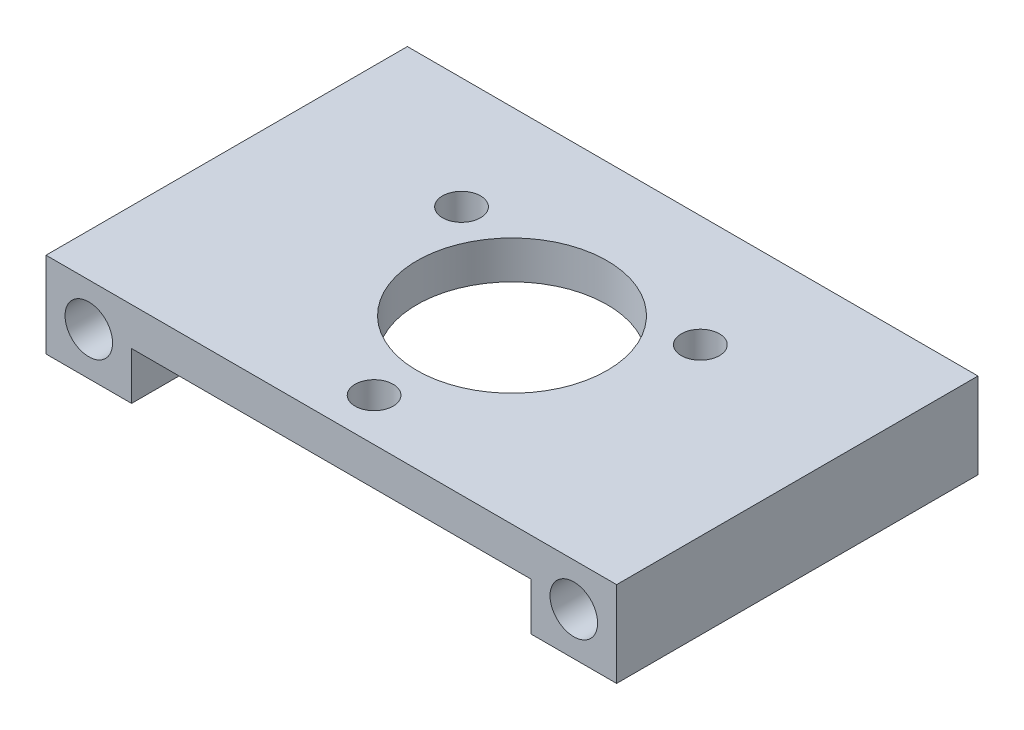
ISO-10303-21;
HEADER;
FILE_DESCRIPTION(('STEP AP214'),'2;1');
FILE_NAME('part.step','',(''),(''),'','','');
FILE_SCHEMA(('AUTOMOTIVE_DESIGN { 1 0 10303 214 1 1 1 1 }'));
ENDSEC;
DATA;
#1=APPLICATION_CONTEXT('core data for automotive mechanical design processes');
#2=APPLICATION_PROTOCOL_DEFINITION('international standard','automotive_design',2000,#1);
#3=PRODUCT_CONTEXT('',#1,'mechanical');
#4=PRODUCT('Part','Part','',(#3));
#5=PRODUCT_RELATED_PRODUCT_CATEGORY('part','',(#4));
#6=PRODUCT_DEFINITION_FORMATION('','',#4);
#7=PRODUCT_DEFINITION_CONTEXT('part definition',#1,'design');
#8=PRODUCT_DEFINITION('design','',#6,#7);
#9=PRODUCT_DEFINITION_SHAPE('','',#8);
#10=(LENGTH_UNIT() NAMED_UNIT(*) SI_UNIT(.MILLI.,.METRE.));
#11=(NAMED_UNIT(*) PLANE_ANGLE_UNIT() SI_UNIT($,.RADIAN.));
#12=(NAMED_UNIT(*) SI_UNIT($,.STERADIAN.) SOLID_ANGLE_UNIT());
#13=UNCERTAINTY_MEASURE_WITH_UNIT(LENGTH_MEASURE(1.E-05),#10,'distance_accuracy_value','');
#14=(GEOMETRIC_REPRESENTATION_CONTEXT(3) GLOBAL_UNCERTAINTY_ASSIGNED_CONTEXT((#13)) GLOBAL_UNIT_ASSIGNED_CONTEXT((#10,
#11,#12)) REPRESENTATION_CONTEXT('',''));
#15=CARTESIAN_POINT('',(0.,0.,0.));
#16=DIRECTION('',(0.,0.,1.));
#17=DIRECTION('',(1.,0.,0.));
#18=AXIS2_PLACEMENT_3D('',#15,#16,#17);
#19=CARTESIAN_POINT('',(0.,0.,38.));
#20=DIRECTION('',(0.,0.,-1.));
#21=DIRECTION('',(-1.,0.,0.));
#22=AXIS2_PLACEMENT_3D('',#19,#20,#21);
#23=PLANE('',#22);
#24=DIRECTION('',(-1.,0.,0.));
#25=VECTOR('',#24,1.);
#26=CARTESIAN_POINT('',(-30.,0.,38.));
#27=LINE('',#26,#25);
#28=CARTESIAN_POINT('',(30.,0.,38.));
#29=VERTEX_POINT('',#28);
#30=CARTESIAN_POINT('',(-30.,0.,38.));
#31=VERTEX_POINT('',#30);
#32=EDGE_CURVE('E145',#29,#31,#27,.T.);
#33=ORIENTED_EDGE('',*,*,#32,.T.);
#34=DIRECTION('',(0.,-1.,0.));
#35=VECTOR('',#34,1.);
#36=CARTESIAN_POINT('',(-30.,0.,38.));
#37=LINE('',#36,#35);
#38=CARTESIAN_POINT('',(-30.,-9.00000000000001,38.));
#39=VERTEX_POINT('',#38);
#40=EDGE_CURVE('E93',#31,#39,#37,.T.);
#41=ORIENTED_EDGE('',*,*,#40,.T.);
#42=DIRECTION('',(1.,0.,0.));
#43=VECTOR('',#42,1.);
#44=CARTESIAN_POINT('',(-30.,-9.00000000000001,38.));
#45=LINE('',#44,#43);
#46=CARTESIAN_POINT('',(-21.,-9.00000000000001,38.));
#47=VERTEX_POINT('',#46);
#48=EDGE_CURVE('E160',#39,#47,#45,.T.);
#49=ORIENTED_EDGE('',*,*,#48,.T.);
#50=DIRECTION('',(0.,1.,0.));
#51=VECTOR('',#50,1.);
#52=CARTESIAN_POINT('',(-21.,-9.00000000000001,38.));
#53=LINE('',#52,#51);
#54=CARTESIAN_POINT('',(-21.,-4.,38.));
#55=VERTEX_POINT('',#54);
#56=EDGE_CURVE('E173',#47,#55,#53,.T.);
#57=ORIENTED_EDGE('',*,*,#56,.T.);
#58=DIRECTION('',(1.,0.,0.));
#59=VECTOR('',#58,1.);
#60=CARTESIAN_POINT('',(-21.,-4.,38.));
#61=LINE('',#60,#59);
#62=CARTESIAN_POINT('',(21.,-4.,38.));
#63=VERTEX_POINT('',#62);
#64=EDGE_CURVE('E112',#55,#63,#61,.T.);
#65=ORIENTED_EDGE('',*,*,#64,.T.);
#66=DIRECTION('',(0.,-1.,0.));
#67=VECTOR('',#66,1.);
#68=CARTESIAN_POINT('',(21.,-9.,38.));
#69=LINE('',#68,#67);
#70=CARTESIAN_POINT('',(21.,-9.,38.));
#71=VERTEX_POINT('',#70);
#72=EDGE_CURVE('E106',#63,#71,#69,.T.);
#73=ORIENTED_EDGE('',*,*,#72,.T.);
#74=DIRECTION('',(1.,0.,0.));
#75=VECTOR('',#74,1.);
#76=CARTESIAN_POINT('',(30.,-9.,38.));
#77=LINE('',#76,#75);
#78=CARTESIAN_POINT('',(30.,-9.,38.));
#79=VERTEX_POINT('',#78);
#80=EDGE_CURVE('E110',#71,#79,#77,.T.);
#81=ORIENTED_EDGE('',*,*,#80,.T.);
#82=DIRECTION('',(0.,1.,0.));
#83=VECTOR('',#82,1.);
#84=CARTESIAN_POINT('',(30.,0.,38.));
#85=LINE('',#84,#83);
#86=EDGE_CURVE('E50',#79,#29,#85,.T.);
#87=ORIENTED_EDGE('',*,*,#86,.T.);
#88=EDGE_LOOP('',(#33,#41,#49,#57,#65,#73,#81,#87));
#89=FACE_BOUND('',#88,.T.);
#90=CARTESIAN_POINT('',(25.5,-4.5,38.));
#91=DIRECTION('',(0.,0.,1.));
#92=DIRECTION('',(-1.,0.,0.));
#93=AXIS2_PLACEMENT_3D('',#90,#91,#92);
#94=CIRCLE('',#93,2.5);
#95=CARTESIAN_POINT('',(23.,-4.5,38.));
#96=VERTEX_POINT('',#95);
#97=EDGE_CURVE('E134',#96,#96,#94,.T.);
#98=ORIENTED_EDGE('',*,*,#97,.F.);
#99=EDGE_LOOP('',(#98));
#100=FACE_BOUND('',#99,.T.);
#101=CARTESIAN_POINT('',(-25.5,-4.5,38.));
#102=DIRECTION('',(0.,0.,1.));
#103=DIRECTION('',(1.,0.,0.));
#104=AXIS2_PLACEMENT_3D('',#101,#102,#103);
#105=CIRCLE('',#104,2.5);
#106=CARTESIAN_POINT('',(-23.,-4.5,38.));
#107=VERTEX_POINT('',#106);
#108=EDGE_CURVE('E182',#107,#107,#105,.T.);
#109=ORIENTED_EDGE('',*,*,#108,.F.);
#110=EDGE_LOOP('',(#109));
#111=FACE_BOUND('',#110,.T.);
#112=ADVANCED_FACE('F33',(#89,#100,#111),#23,.F.);
#113=CARTESIAN_POINT('',(0.,0.,0.));
#114=DIRECTION('',(0.,0.,-1.));
#115=DIRECTION('',(-1.,0.,0.));
#116=AXIS2_PLACEMENT_3D('',#113,#114,#115);
#117=PLANE('',#116);
#118=CARTESIAN_POINT('',(25.5,-4.5,0.));
#119=DIRECTION('',(0.,0.,1.));
#120=DIRECTION('',(-1.,0.,0.));
#121=AXIS2_PLACEMENT_3D('',#118,#119,#120);
#122=CIRCLE('',#121,2.5);
#123=CARTESIAN_POINT('',(23.,-4.5,0.));
#124=VERTEX_POINT('',#123);
#125=EDGE_CURVE('E179',#124,#124,#122,.T.);
#126=ORIENTED_EDGE('',*,*,#125,.T.);
#127=EDGE_LOOP('',(#126));
#128=FACE_BOUND('',#127,.T.);
#129=DIRECTION('',(-1.,0.,0.));
#130=VECTOR('',#129,1.);
#131=CARTESIAN_POINT('',(-30.,0.,0.));
#132=LINE('',#131,#130);
#133=CARTESIAN_POINT('',(30.,0.,0.));
#134=VERTEX_POINT('',#133);
#135=CARTESIAN_POINT('',(-30.,0.,0.));
#136=VERTEX_POINT('',#135);
#137=EDGE_CURVE('E130',#134,#136,#132,.T.);
#138=ORIENTED_EDGE('',*,*,#137,.F.);
#139=DIRECTION('',(0.,1.,0.));
#140=VECTOR('',#139,1.);
#141=CARTESIAN_POINT('',(30.,0.,0.));
#142=LINE('',#141,#140);
#143=CARTESIAN_POINT('',(30.,-9.,0.));
#144=VERTEX_POINT('',#143);
#145=EDGE_CURVE('E85',#144,#134,#142,.T.);
#146=ORIENTED_EDGE('',*,*,#145,.F.);
#147=DIRECTION('',(1.,0.,0.));
#148=VECTOR('',#147,1.);
#149=CARTESIAN_POINT('',(30.,-9.,0.));
#150=LINE('',#149,#148);
#151=CARTESIAN_POINT('',(21.,-9.,0.));
#152=VERTEX_POINT('',#151);
#153=EDGE_CURVE('E79',#152,#144,#150,.T.);
#154=ORIENTED_EDGE('',*,*,#153,.F.);
#155=DIRECTION('',(0.,-1.,0.));
#156=VECTOR('',#155,1.);
#157=CARTESIAN_POINT('',(21.,-9.,0.));
#158=LINE('',#157,#156);
#159=CARTESIAN_POINT('',(21.,-4.,0.));
#160=VERTEX_POINT('',#159);
#161=EDGE_CURVE('E120',#160,#152,#158,.T.);
#162=ORIENTED_EDGE('',*,*,#161,.F.);
#163=DIRECTION('',(1.,0.,0.));
#164=VECTOR('',#163,1.);
#165=CARTESIAN_POINT('',(-21.,-4.,0.));
#166=LINE('',#165,#164);
#167=CARTESIAN_POINT('',(-21.,-4.,0.));
#168=VERTEX_POINT('',#167);
#169=EDGE_CURVE('E140',#168,#160,#166,.T.);
#170=ORIENTED_EDGE('',*,*,#169,.F.);
#171=DIRECTION('',(0.,1.,0.));
#172=VECTOR('',#171,1.);
#173=CARTESIAN_POINT('',(-21.,-9.00000000000001,0.));
#174=LINE('',#173,#172);
#175=CARTESIAN_POINT('',(-21.,-9.00000000000001,0.));
#176=VERTEX_POINT('',#175);
#177=EDGE_CURVE('E138',#176,#168,#174,.T.);
#178=ORIENTED_EDGE('',*,*,#177,.F.);
#179=DIRECTION('',(1.,0.,0.));
#180=VECTOR('',#179,1.);
#181=CARTESIAN_POINT('',(-30.,-9.00000000000001,0.));
#182=LINE('',#181,#180);
#183=CARTESIAN_POINT('',(-30.,-9.00000000000001,0.));
#184=VERTEX_POINT('',#183);
#185=EDGE_CURVE('E136',#184,#176,#182,.T.);
#186=ORIENTED_EDGE('',*,*,#185,.F.);
#187=DIRECTION('',(0.,-1.,0.));
#188=VECTOR('',#187,1.);
#189=CARTESIAN_POINT('',(-30.,0.,0.));
#190=LINE('',#189,#188);
#191=EDGE_CURVE('E133',#136,#184,#190,.T.);
#192=ORIENTED_EDGE('',*,*,#191,.F.);
#193=EDGE_LOOP('',(#138,#146,#154,#162,#170,#178,#186,#192));
#194=FACE_BOUND('',#193,.T.);
#195=CARTESIAN_POINT('',(-25.5,-4.5,0.));
#196=DIRECTION('',(0.,0.,1.));
#197=DIRECTION('',(1.,0.,0.));
#198=AXIS2_PLACEMENT_3D('',#195,#196,#197);
#199=CIRCLE('',#198,2.5);
#200=CARTESIAN_POINT('',(-23.,-4.5,0.));
#201=VERTEX_POINT('',#200);
#202=EDGE_CURVE('E185',#201,#201,#199,.T.);
#203=ORIENTED_EDGE('',*,*,#202,.T.);
#204=EDGE_LOOP('',(#203));
#205=FACE_BOUND('',#204,.T.);
#206=ADVANCED_FACE('F164',(#128,#194,#205),#117,.T.);
#207=CARTESIAN_POINT('',(-30.,0.,38.));
#208=DIRECTION('',(0.,-1.,0.));
#209=DIRECTION('',(1.,0.,0.));
#210=AXIS2_PLACEMENT_3D('',#207,#208,#209);
#211=PLANE('',#210);
#212=CARTESIAN_POINT('',(-12.5573683548735,0.,11.7499999999996));
#213=DIRECTION('',(0.,-1.,0.));
#214=DIRECTION('',(1.,0.,0.));
#215=AXIS2_PLACEMENT_3D('',#212,#213,#214);
#216=CIRCLE('',#215,2.);
#217=CARTESIAN_POINT('',(-10.5573683548735,0.,11.7499999999996));
#218=VERTEX_POINT('',#217);
#219=EDGE_CURVE('E188',#218,#218,#216,.T.);
#220=ORIENTED_EDGE('',*,*,#219,.T.);
#221=EDGE_LOOP('',(#220));
#222=FACE_BOUND('',#221,.T.);
#223=CARTESIAN_POINT('',(12.5573683548752,0.,11.7500000000005));
#224=DIRECTION('',(0.,-1.,0.));
#225=DIRECTION('',(1.,0.,0.));
#226=AXIS2_PLACEMENT_3D('',#223,#224,#225);
#227=CIRCLE('',#226,2.);
#228=CARTESIAN_POINT('',(14.5573683548752,0.,11.7500000000005));
#229=VERTEX_POINT('',#228);
#230=EDGE_CURVE('E193',#229,#229,#227,.T.);
#231=ORIENTED_EDGE('',*,*,#230,.T.);
#232=EDGE_LOOP('',(#231));
#233=FACE_BOUND('',#232,.T.);
#234=CARTESIAN_POINT('',(0.,0.,33.5));
#235=DIRECTION('',(0.,-1.,0.));
#236=DIRECTION('',(1.,0.,0.));
#237=AXIS2_PLACEMENT_3D('',#234,#235,#236);
#238=CIRCLE('',#237,2.);
#239=CARTESIAN_POINT('',(2.,0.,33.5));
#240=VERTEX_POINT('',#239);
#241=EDGE_CURVE('E196',#240,#240,#238,.T.);
#242=ORIENTED_EDGE('',*,*,#241,.T.);
#243=EDGE_LOOP('',(#242));
#244=FACE_BOUND('',#243,.T.);
#245=CARTESIAN_POINT('',(0.,0.,19.));
#246=DIRECTION('',(0.,-1.,0.));
#247=DIRECTION('',(1.,0.,0.));
#248=AXIS2_PLACEMENT_3D('',#245,#246,#247);
#249=CIRCLE('',#248,10.);
#250=CARTESIAN_POINT('',(10.,0.,19.));
#251=VERTEX_POINT('',#250);
#252=EDGE_CURVE('E199',#251,#251,#249,.T.);
#253=ORIENTED_EDGE('',*,*,#252,.T.);
#254=EDGE_LOOP('',(#253));
#255=FACE_BOUND('',#254,.T.);
#256=ORIENTED_EDGE('',*,*,#137,.T.);
#257=DIRECTION('',(0.,0.,-1.));
#258=VECTOR('',#257,1.);
#259=CARTESIAN_POINT('',(-30.,0.,38.));
#260=LINE('',#259,#258);
#261=EDGE_CURVE('E11',#31,#136,#260,.T.);
#262=ORIENTED_EDGE('',*,*,#261,.F.);
#263=ORIENTED_EDGE('',*,*,#32,.F.);
#264=DIRECTION('',(0.,0.,-1.));
#265=VECTOR('',#264,1.);
#266=CARTESIAN_POINT('',(30.,0.,38.));
#267=LINE('',#266,#265);
#268=EDGE_CURVE('E126',#29,#134,#267,.T.);
#269=ORIENTED_EDGE('',*,*,#268,.T.);
#270=EDGE_LOOP('',(#256,#262,#263,#269));
#271=FACE_BOUND('',#270,.T.);
#272=ADVANCED_FACE('F35',(#222,#233,#244,#255,#271),#211,.F.);
#273=CARTESIAN_POINT('',(-30.,0.,38.));
#274=DIRECTION('',(1.,0.,0.));
#275=DIRECTION('',(0.,0.,-1.));
#276=AXIS2_PLACEMENT_3D('',#273,#274,#275);
#277=PLANE('',#276);
#278=ORIENTED_EDGE('',*,*,#191,.T.);
#279=DIRECTION('',(0.,0.,-1.));
#280=VECTOR('',#279,1.);
#281=CARTESIAN_POINT('',(-30.,-9.00000000000001,38.));
#282=LINE('',#281,#280);
#283=EDGE_CURVE('E42',#39,#184,#282,.T.);
#284=ORIENTED_EDGE('',*,*,#283,.F.);
#285=ORIENTED_EDGE('',*,*,#40,.F.);
#286=ORIENTED_EDGE('',*,*,#261,.T.);
#287=EDGE_LOOP('',(#278,#284,#285,#286));
#288=FACE_BOUND('',#287,.T.);
#289=ADVANCED_FACE('F233',(#288),#277,.F.);
#290=CARTESIAN_POINT('',(-30.,-9.00000000000001,38.));
#291=DIRECTION('',(0.,1.,0.));
#292=DIRECTION('',(0.,0.,1.));
#293=AXIS2_PLACEMENT_3D('',#290,#291,#292);
#294=PLANE('',#293);
#295=ORIENTED_EDGE('',*,*,#185,.T.);
#296=DIRECTION('',(0.,0.,-1.));
#297=VECTOR('',#296,1.);
#298=CARTESIAN_POINT('',(-21.,-9.00000000000001,38.));
#299=LINE('',#298,#297);
#300=EDGE_CURVE('E152',#47,#176,#299,.T.);
#301=ORIENTED_EDGE('',*,*,#300,.F.);
#302=ORIENTED_EDGE('',*,*,#48,.F.);
#303=ORIENTED_EDGE('',*,*,#283,.T.);
#304=EDGE_LOOP('',(#295,#301,#302,#303));
#305=FACE_BOUND('',#304,.T.);
#306=ADVANCED_FACE('F158',(#305),#294,.F.);
#307=CARTESIAN_POINT('',(-21.,-9.00000000000001,38.));
#308=DIRECTION('',(-1.,0.,0.));
#309=DIRECTION('',(0.,0.,1.));
#310=AXIS2_PLACEMENT_3D('',#307,#308,#309);
#311=PLANE('',#310);
#312=ORIENTED_EDGE('',*,*,#177,.T.);
#313=DIRECTION('',(0.,0.,-1.));
#314=VECTOR('',#313,1.);
#315=CARTESIAN_POINT('',(-21.,-4.,38.));
#316=LINE('',#315,#314);
#317=EDGE_CURVE('E149',#55,#168,#316,.T.);
#318=ORIENTED_EDGE('',*,*,#317,.F.);
#319=ORIENTED_EDGE('',*,*,#56,.F.);
#320=ORIENTED_EDGE('',*,*,#300,.T.);
#321=EDGE_LOOP('',(#312,#318,#319,#320));
#322=FACE_BOUND('',#321,.T.);
#323=ADVANCED_FACE('F169',(#322),#311,.F.);
#324=CARTESIAN_POINT('',(-21.,-4.,38.));
#325=DIRECTION('',(0.,1.,0.));
#326=DIRECTION('',(0.,0.,1.));
#327=AXIS2_PLACEMENT_3D('',#324,#325,#326);
#328=PLANE('',#327);
#329=CARTESIAN_POINT('',(-12.5573683548735,-4.,11.7499999999996));
#330=DIRECTION('',(0.,-1.,0.));
#331=DIRECTION('',(1.,0.,0.));
#332=AXIS2_PLACEMENT_3D('',#329,#330,#331);
#333=CIRCLE('',#332,2.);
#334=CARTESIAN_POINT('',(-10.5573683548735,-4.,11.7499999999996));
#335=VERTEX_POINT('',#334);
#336=EDGE_CURVE('E206',#335,#335,#333,.T.);
#337=ORIENTED_EDGE('',*,*,#336,.F.);
#338=EDGE_LOOP('',(#337));
#339=FACE_BOUND('',#338,.T.);
#340=CARTESIAN_POINT('',(12.5573683548752,-4.,11.7500000000005));
#341=DIRECTION('',(0.,-1.,0.));
#342=DIRECTION('',(1.,0.,0.));
#343=AXIS2_PLACEMENT_3D('',#340,#341,#342);
#344=CIRCLE('',#343,2.);
#345=CARTESIAN_POINT('',(14.5573683548752,-4.,11.7500000000005));
#346=VERTEX_POINT('',#345);
#347=EDGE_CURVE('E209',#346,#346,#344,.T.);
#348=ORIENTED_EDGE('',*,*,#347,.F.);
#349=EDGE_LOOP('',(#348));
#350=FACE_BOUND('',#349,.T.);
#351=CARTESIAN_POINT('',(0.,-4.,33.5));
#352=DIRECTION('',(0.,-1.,0.));
#353=DIRECTION('',(1.,0.,0.));
#354=AXIS2_PLACEMENT_3D('',#351,#352,#353);
#355=CIRCLE('',#354,2.);
#356=CARTESIAN_POINT('',(2.,-4.,33.5));
#357=VERTEX_POINT('',#356);
#358=EDGE_CURVE('E205',#357,#357,#355,.T.);
#359=ORIENTED_EDGE('',*,*,#358,.F.);
#360=EDGE_LOOP('',(#359));
#361=FACE_BOUND('',#360,.T.);
#362=CARTESIAN_POINT('',(0.,-4.,19.));
#363=DIRECTION('',(0.,-1.,0.));
#364=DIRECTION('',(1.,0.,0.));
#365=AXIS2_PLACEMENT_3D('',#362,#363,#364);
#366=CIRCLE('',#365,10.);
#367=CARTESIAN_POINT('',(10.,-4.,19.));
#368=VERTEX_POINT('',#367);
#369=EDGE_CURVE('E202',#368,#368,#366,.T.);
#370=ORIENTED_EDGE('',*,*,#369,.F.);
#371=EDGE_LOOP('',(#370));
#372=FACE_BOUND('',#371,.T.);
#373=ORIENTED_EDGE('',*,*,#169,.T.);
#374=DIRECTION('',(0.,0.,-1.));
#375=VECTOR('',#374,1.);
#376=CARTESIAN_POINT('',(21.,-4.,38.));
#377=LINE('',#376,#375);
#378=EDGE_CURVE('E121',#63,#160,#377,.T.);
#379=ORIENTED_EDGE('',*,*,#378,.F.);
#380=ORIENTED_EDGE('',*,*,#64,.F.);
#381=ORIENTED_EDGE('',*,*,#317,.T.);
#382=EDGE_LOOP('',(#373,#379,#380,#381));
#383=FACE_BOUND('',#382,.T.);
#384=ADVANCED_FACE('F172',(#339,#350,#361,#372,#383),#328,.F.);
#385=CARTESIAN_POINT('',(21.,-9.,38.));
#386=DIRECTION('',(1.,0.,0.));
#387=DIRECTION('',(0.,1.,0.));
#388=AXIS2_PLACEMENT_3D('',#385,#386,#387);
#389=PLANE('',#388);
#390=ORIENTED_EDGE('',*,*,#161,.T.);
#391=DIRECTION('',(0.,0.,-1.));
#392=VECTOR('',#391,1.);
#393=CARTESIAN_POINT('',(21.,-9.,38.));
#394=LINE('',#393,#392);
#395=EDGE_CURVE('E117',#71,#152,#394,.T.);
#396=ORIENTED_EDGE('',*,*,#395,.F.);
#397=ORIENTED_EDGE('',*,*,#72,.F.);
#398=ORIENTED_EDGE('',*,*,#378,.T.);
#399=EDGE_LOOP('',(#390,#396,#397,#398));
#400=FACE_BOUND('',#399,.T.);
#401=ADVANCED_FACE('F118',(#400),#389,.F.);
#402=CARTESIAN_POINT('',(30.,-9.,38.));
#403=DIRECTION('',(0.,1.,0.));
#404=DIRECTION('',(0.,0.,1.));
#405=AXIS2_PLACEMENT_3D('',#402,#403,#404);
#406=PLANE('',#405);
#407=ORIENTED_EDGE('',*,*,#153,.T.);
#408=DIRECTION('',(0.,0.,-1.));
#409=VECTOR('',#408,1.);
#410=CARTESIAN_POINT('',(30.,-9.,38.));
#411=LINE('',#410,#409);
#412=EDGE_CURVE('E122',#79,#144,#411,.T.);
#413=ORIENTED_EDGE('',*,*,#412,.F.);
#414=ORIENTED_EDGE('',*,*,#80,.F.);
#415=ORIENTED_EDGE('',*,*,#395,.T.);
#416=EDGE_LOOP('',(#407,#413,#414,#415));
#417=FACE_BOUND('',#416,.T.);
#418=ADVANCED_FACE('F124',(#417),#406,.F.);
#419=CARTESIAN_POINT('',(30.,0.,38.));
#420=DIRECTION('',(-1.,0.,0.));
#421=DIRECTION('',(0.,0.,1.));
#422=AXIS2_PLACEMENT_3D('',#419,#420,#421);
#423=PLANE('',#422);
#424=ORIENTED_EDGE('',*,*,#145,.T.);
#425=ORIENTED_EDGE('',*,*,#268,.F.);
#426=ORIENTED_EDGE('',*,*,#86,.F.);
#427=ORIENTED_EDGE('',*,*,#412,.T.);
#428=EDGE_LOOP('',(#424,#425,#426,#427));
#429=FACE_BOUND('',#428,.T.);
#430=ADVANCED_FACE('F237',(#429),#423,.F.);
#431=CARTESIAN_POINT('',(25.5,-4.5,38.));
#432=DIRECTION('',(0.,0.,-1.));
#433=DIRECTION('',(-1.,0.,0.));
#434=AXIS2_PLACEMENT_3D('',#431,#432,#433);
#435=CYLINDRICAL_SURFACE('',#434,2.5);
#436=ORIENTED_EDGE('',*,*,#97,.T.);
#437=EDGE_LOOP('',(#436));
#438=FACE_BOUND('',#437,.T.);
#439=ORIENTED_EDGE('',*,*,#125,.F.);
#440=EDGE_LOOP('',(#439));
#441=FACE_BOUND('',#440,.T.);
#442=ADVANCED_FACE('F239',(#438,#441),#435,.F.);
#443=CARTESIAN_POINT('',(-25.5,-4.5,38.));
#444=DIRECTION('',(0.,0.,-1.));
#445=DIRECTION('',(-1.,0.,0.));
#446=AXIS2_PLACEMENT_3D('',#443,#444,#445);
#447=CYLINDRICAL_SURFACE('',#446,2.5);
#448=ORIENTED_EDGE('',*,*,#108,.T.);
#449=EDGE_LOOP('',(#448));
#450=FACE_BOUND('',#449,.T.);
#451=ORIENTED_EDGE('',*,*,#202,.F.);
#452=EDGE_LOOP('',(#451));
#453=FACE_BOUND('',#452,.T.);
#454=ADVANCED_FACE('F227',(#450,#453),#447,.F.);
#455=CARTESIAN_POINT('',(0.,34.,19.));
#456=DIRECTION('',(0.,-1.,0.));
#457=DIRECTION('',(1.,0.,0.));
#458=AXIS2_PLACEMENT_3D('',#455,#456,#457);
#459=CYLINDRICAL_SURFACE('',#458,10.);
#460=ORIENTED_EDGE('',*,*,#369,.T.);
#461=EDGE_LOOP('',(#460));
#462=FACE_BOUND('',#461,.T.);
#463=ORIENTED_EDGE('',*,*,#252,.F.);
#464=EDGE_LOOP('',(#463));
#465=FACE_BOUND('',#464,.T.);
#466=ADVANCED_FACE('F224',(#462,#465),#459,.F.);
#467=CARTESIAN_POINT('',(0.,34.,33.5));
#468=DIRECTION('',(0.,-1.,0.));
#469=DIRECTION('',(1.,0.,0.));
#470=AXIS2_PLACEMENT_3D('',#467,#468,#469);
#471=CYLINDRICAL_SURFACE('',#470,2.);
#472=ORIENTED_EDGE('',*,*,#358,.T.);
#473=EDGE_LOOP('',(#472));
#474=FACE_BOUND('',#473,.T.);
#475=ORIENTED_EDGE('',*,*,#241,.F.);
#476=EDGE_LOOP('',(#475));
#477=FACE_BOUND('',#476,.T.);
#478=ADVANCED_FACE('F215',(#474,#477),#471,.F.);
#479=CARTESIAN_POINT('',(12.5573683548753,34.,11.7500000000005));
#480=DIRECTION('',(0.,-1.,0.));
#481=DIRECTION('',(1.,0.,0.));
#482=AXIS2_PLACEMENT_3D('',#479,#480,#481);
#483=CYLINDRICAL_SURFACE('',#482,2.);
#484=ORIENTED_EDGE('',*,*,#347,.T.);
#485=EDGE_LOOP('',(#484));
#486=FACE_BOUND('',#485,.T.);
#487=ORIENTED_EDGE('',*,*,#230,.F.);
#488=EDGE_LOOP('',(#487));
#489=FACE_BOUND('',#488,.T.);
#490=ADVANCED_FACE('F262',(#486,#489),#483,.F.);
#491=CARTESIAN_POINT('',(-12.5573683548735,34.,11.7499999999996));
#492=DIRECTION('',(0.,-1.,0.));
#493=DIRECTION('',(1.,0.,0.));
#494=AXIS2_PLACEMENT_3D('',#491,#492,#493);
#495=CYLINDRICAL_SURFACE('',#494,2.);
#496=ORIENTED_EDGE('',*,*,#336,.T.);
#497=EDGE_LOOP('',(#496));
#498=FACE_BOUND('',#497,.T.);
#499=ORIENTED_EDGE('',*,*,#219,.F.);
#500=EDGE_LOOP('',(#499));
#501=FACE_BOUND('',#500,.T.);
#502=ADVANCED_FACE('F259',(#498,#501),#495,.F.);
#503=CLOSED_SHELL('',(#112,#206,#272,#289,#306,#323,#384,#401,#418,#430,#442,#454,#466,#478,
#490,#502));
#504=MANIFOLD_SOLID_BREP('B2',#503);
#505=ADVANCED_BREP_SHAPE_REPRESENTATION('',(#18,#504),#14);
#506=SHAPE_DEFINITION_REPRESENTATION(#9,#505);
ENDSEC;
END-ISO-10303-21;
